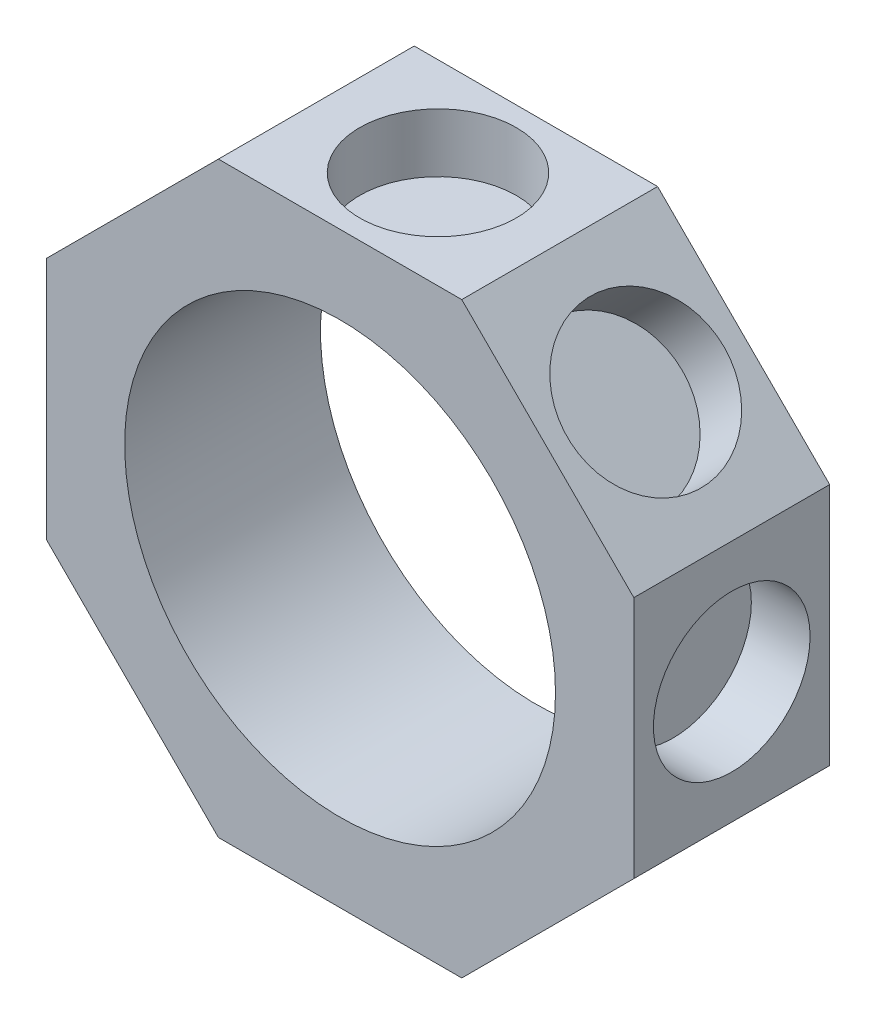
ISO-10303-21;
HEADER;
FILE_DESCRIPTION(('STEP AP214'),'2;1');
FILE_NAME('part.step','',(''),(''),'','','');
FILE_SCHEMA(('AUTOMOTIVE_DESIGN { 1 0 10303 214 1 1 1 1 }'));
ENDSEC;
DATA;
#1=APPLICATION_CONTEXT('core data for automotive mechanical design processes');
#2=APPLICATION_PROTOCOL_DEFINITION('international standard','automotive_design',2000,#1);
#3=PRODUCT_CONTEXT('',#1,'mechanical');
#4=PRODUCT('Part','Part','',(#3));
#5=PRODUCT_RELATED_PRODUCT_CATEGORY('part','',(#4));
#6=PRODUCT_DEFINITION_FORMATION('','',#4);
#7=PRODUCT_DEFINITION_CONTEXT('part definition',#1,'design');
#8=PRODUCT_DEFINITION('design','',#6,#7);
#9=PRODUCT_DEFINITION_SHAPE('','',#8);
#10=(LENGTH_UNIT() NAMED_UNIT(*) SI_UNIT(.MILLI.,.METRE.));
#11=(NAMED_UNIT(*) PLANE_ANGLE_UNIT() SI_UNIT($,.RADIAN.));
#12=(NAMED_UNIT(*) SI_UNIT($,.STERADIAN.) SOLID_ANGLE_UNIT());
#13=UNCERTAINTY_MEASURE_WITH_UNIT(LENGTH_MEASURE(1.E-05),#10,'distance_accuracy_value','');
#14=(GEOMETRIC_REPRESENTATION_CONTEXT(3) GLOBAL_UNCERTAINTY_ASSIGNED_CONTEXT((#13)) GLOBAL_UNIT_ASSIGNED_CONTEXT((#10,
#11,#12)) REPRESENTATION_CONTEXT('',''));
#15=CARTESIAN_POINT('',(0.,0.,0.));
#16=DIRECTION('',(0.,0.,1.));
#17=DIRECTION('',(1.,0.,0.));
#18=AXIS2_PLACEMENT_3D('',#15,#16,#17);
#19=CARTESIAN_POINT('',(0.,0.,5.));
#20=DIRECTION('',(0.,0.,1.));
#21=DIRECTION('',(1.,0.,0.));
#22=AXIS2_PLACEMENT_3D('',#19,#20,#21);
#23=PLANE('',#22);
#24=DIRECTION('',(-0.707106781186547,-0.707106781186548,0.));
#25=VECTOR('',#24,1.);
#26=CARTESIAN_POINT('',(-6.21320343559643,15.,5.));
#27=LINE('',#26,#25);
#28=CARTESIAN_POINT('',(-6.21320343559643,15.,5.));
#29=VERTEX_POINT('',#28);
#30=CARTESIAN_POINT('',(-15.,6.21320343559641,5.));
#31=VERTEX_POINT('',#30);
#32=EDGE_CURVE('E170',#29,#31,#27,.T.);
#33=ORIENTED_EDGE('',*,*,#32,.T.);
#34=DIRECTION('',(0.,-1.,0.));
#35=VECTOR('',#34,1.);
#36=CARTESIAN_POINT('',(-15.,6.21320343559641,5.));
#37=LINE('',#36,#35);
#38=CARTESIAN_POINT('',(-15.,-6.21320343559641,5.));
#39=VERTEX_POINT('',#38);
#40=EDGE_CURVE('E106',#31,#39,#37,.T.);
#41=ORIENTED_EDGE('',*,*,#40,.T.);
#42=DIRECTION('',(0.707106781186547,-0.707106781186548,0.));
#43=VECTOR('',#42,1.);
#44=CARTESIAN_POINT('',(-15.,-6.21320343559641,5.));
#45=LINE('',#44,#43);
#46=CARTESIAN_POINT('',(-6.2132034355964,-15.,5.));
#47=VERTEX_POINT('',#46);
#48=EDGE_CURVE('E191',#39,#47,#45,.T.);
#49=ORIENTED_EDGE('',*,*,#48,.T.);
#50=DIRECTION('',(1.,0.,0.));
#51=VECTOR('',#50,1.);
#52=CARTESIAN_POINT('',(-6.2132034355964,-15.,5.));
#53=LINE('',#52,#51);
#54=CARTESIAN_POINT('',(6.21320343559643,-15.,5.));
#55=VERTEX_POINT('',#54);
#56=EDGE_CURVE('E205',#47,#55,#53,.T.);
#57=ORIENTED_EDGE('',*,*,#56,.T.);
#58=DIRECTION('',(0.707106781186548,0.707106781186548,0.));
#59=VECTOR('',#58,1.);
#60=CARTESIAN_POINT('',(6.21320343559643,-15.,5.));
#61=LINE('',#60,#59);
#62=CARTESIAN_POINT('',(15.,-6.21320343559643,5.));
#63=VERTEX_POINT('',#62);
#64=EDGE_CURVE('E125',#55,#63,#61,.T.);
#65=ORIENTED_EDGE('',*,*,#64,.T.);
#66=DIRECTION('',(0.,1.,0.));
#67=VECTOR('',#66,1.);
#68=CARTESIAN_POINT('',(15.,-6.21320343559643,5.));
#69=LINE('',#68,#67);
#70=CARTESIAN_POINT('',(15.,6.21320343559643,5.));
#71=VERTEX_POINT('',#70);
#72=EDGE_CURVE('E119',#63,#71,#69,.T.);
#73=ORIENTED_EDGE('',*,*,#72,.T.);
#74=DIRECTION('',(-0.707106781186548,0.707106781186547,0.));
#75=VECTOR('',#74,1.);
#76=CARTESIAN_POINT('',(15.,6.21320343559643,5.));
#77=LINE('',#76,#75);
#78=CARTESIAN_POINT('',(6.21320343559642,15.,5.));
#79=VERTEX_POINT('',#78);
#80=EDGE_CURVE('E123',#71,#79,#77,.T.);
#81=ORIENTED_EDGE('',*,*,#80,.T.);
#82=DIRECTION('',(-1.,0.,0.));
#83=VECTOR('',#82,1.);
#84=CARTESIAN_POINT('',(6.21320343559642,15.,5.));
#85=LINE('',#84,#83);
#86=EDGE_CURVE('E63',#79,#29,#85,.T.);
#87=ORIENTED_EDGE('',*,*,#86,.T.);
#88=EDGE_LOOP('',(#33,#41,#49,#57,#65,#73,#81,#87));
#89=FACE_BOUND('',#88,.T.);
#90=CARTESIAN_POINT('',(0.,0.,5.));
#91=DIRECTION('',(0.,0.,1.));
#92=DIRECTION('',(1.,0.,0.));
#93=AXIS2_PLACEMENT_3D('',#90,#91,#92);
#94=CIRCLE('',#93,11.);
#95=CARTESIAN_POINT('',(11.,0.,5.));
#96=VERTEX_POINT('',#95);
#97=EDGE_CURVE('E152',#96,#96,#94,.T.);
#98=ORIENTED_EDGE('',*,*,#97,.F.);
#99=EDGE_LOOP('',(#98));
#100=FACE_BOUND('',#99,.T.);
#101=ADVANCED_FACE('F45',(#89,#100),#23,.T.);
#102=CARTESIAN_POINT('',(0.,0.,-5.));
#103=DIRECTION('',(0.,0.,1.));
#104=DIRECTION('',(1.,0.,0.));
#105=AXIS2_PLACEMENT_3D('',#102,#103,#104);
#106=PLANE('',#105);
#107=DIRECTION('',(-0.707106781186547,-0.707106781186548,0.));
#108=VECTOR('',#107,1.);
#109=CARTESIAN_POINT('',(-6.21320343559643,15.,-5.));
#110=LINE('',#109,#108);
#111=CARTESIAN_POINT('',(-6.21320343559643,15.,-5.));
#112=VERTEX_POINT('',#111);
#113=CARTESIAN_POINT('',(-15.,6.21320343559641,-5.));
#114=VERTEX_POINT('',#113);
#115=EDGE_CURVE('E147',#112,#114,#110,.T.);
#116=ORIENTED_EDGE('',*,*,#115,.F.);
#117=DIRECTION('',(-1.,0.,0.));
#118=VECTOR('',#117,1.);
#119=CARTESIAN_POINT('',(6.21320343559642,15.,-5.));
#120=LINE('',#119,#118);
#121=CARTESIAN_POINT('',(6.21320343559642,15.,-5.));
#122=VERTEX_POINT('',#121);
#123=EDGE_CURVE('E98',#122,#112,#120,.T.);
#124=ORIENTED_EDGE('',*,*,#123,.F.);
#125=DIRECTION('',(-0.707106781186548,0.707106781186547,0.));
#126=VECTOR('',#125,1.);
#127=CARTESIAN_POINT('',(15.,6.21320343559643,-5.));
#128=LINE('',#127,#126);
#129=CARTESIAN_POINT('',(15.,6.21320343559643,-5.));
#130=VERTEX_POINT('',#129);
#131=EDGE_CURVE('E92',#130,#122,#128,.T.);
#132=ORIENTED_EDGE('',*,*,#131,.F.);
#133=DIRECTION('',(0.,1.,0.));
#134=VECTOR('',#133,1.);
#135=CARTESIAN_POINT('',(15.,-6.21320343559643,-5.));
#136=LINE('',#135,#134);
#137=CARTESIAN_POINT('',(15.,-6.21320343559643,-5.));
#138=VERTEX_POINT('',#137);
#139=EDGE_CURVE('E134',#138,#130,#136,.T.);
#140=ORIENTED_EDGE('',*,*,#139,.F.);
#141=DIRECTION('',(0.707106781186548,0.707106781186548,0.));
#142=VECTOR('',#141,1.);
#143=CARTESIAN_POINT('',(6.21320343559643,-15.,-5.));
#144=LINE('',#143,#142);
#145=CARTESIAN_POINT('',(6.21320343559643,-15.,-5.));
#146=VERTEX_POINT('',#145);
#147=EDGE_CURVE('E161',#146,#138,#144,.T.);
#148=ORIENTED_EDGE('',*,*,#147,.F.);
#149=DIRECTION('',(1.,0.,0.));
#150=VECTOR('',#149,1.);
#151=CARTESIAN_POINT('',(-6.2132034355964,-15.,-5.));
#152=LINE('',#151,#150);
#153=CARTESIAN_POINT('',(-6.2132034355964,-15.,-5.));
#154=VERTEX_POINT('',#153);
#155=EDGE_CURVE('E158',#154,#146,#152,.T.);
#156=ORIENTED_EDGE('',*,*,#155,.F.);
#157=DIRECTION('',(0.707106781186547,-0.707106781186548,0.));
#158=VECTOR('',#157,1.);
#159=CARTESIAN_POINT('',(-15.,-6.21320343559641,-5.));
#160=LINE('',#159,#158);
#161=CARTESIAN_POINT('',(-15.,-6.21320343559641,-5.));
#162=VERTEX_POINT('',#161);
#163=EDGE_CURVE('E155',#162,#154,#160,.T.);
#164=ORIENTED_EDGE('',*,*,#163,.F.);
#165=DIRECTION('',(0.,-1.,0.));
#166=VECTOR('',#165,1.);
#167=CARTESIAN_POINT('',(-15.,6.21320343559641,-5.));
#168=LINE('',#167,#166);
#169=EDGE_CURVE('E151',#114,#162,#168,.T.);
#170=ORIENTED_EDGE('',*,*,#169,.F.);
#171=EDGE_LOOP('',(#116,#124,#132,#140,#148,#156,#164,#170));
#172=FACE_BOUND('',#171,.T.);
#173=CARTESIAN_POINT('',(0.,0.,-5.));
#174=DIRECTION('',(0.,0.,1.));
#175=DIRECTION('',(1.,0.,0.));
#176=AXIS2_PLACEMENT_3D('',#173,#174,#175);
#177=CIRCLE('',#176,11.);
#178=CARTESIAN_POINT('',(11.,0.,-5.));
#179=VERTEX_POINT('',#178);
#180=EDGE_CURVE('E215',#179,#179,#177,.T.);
#181=ORIENTED_EDGE('',*,*,#180,.T.);
#182=EDGE_LOOP('',(#181));
#183=FACE_BOUND('',#182,.T.);
#184=ADVANCED_FACE('F195',(#172,#183),#106,.F.);
#185=CARTESIAN_POINT('',(-6.21320343559643,15.,5.));
#186=DIRECTION('',(0.707106781186548,-0.707106781186547,0.));
#187=DIRECTION('',(0.707106781186547,0.707106781186548,0.));
#188=AXIS2_PLACEMENT_3D('',#185,#186,#187);
#189=PLANE('',#188);
#190=CARTESIAN_POINT('',(-10.6066017177983,10.6066017177981,0.));
#191=DIRECTION('',(-0.707106781186554,0.707106781186541,0.));
#192=DIRECTION('',(0.,0.,-1.));
#193=AXIS2_PLACEMENT_3D('',#190,#191,#192);
#194=CIRCLE('',#193,4.);
#195=CARTESIAN_POINT('',(-10.6066017177983,10.6066017177981,-4.));
#196=VERTEX_POINT('',#195);
#197=EDGE_CURVE('E239',#196,#196,#194,.T.);
#198=ORIENTED_EDGE('',*,*,#197,.F.);
#199=EDGE_LOOP('',(#198));
#200=FACE_BOUND('',#199,.T.);
#201=ORIENTED_EDGE('',*,*,#115,.T.);
#202=DIRECTION('',(0.,0.,-1.));
#203=VECTOR('',#202,1.);
#204=CARTESIAN_POINT('',(-15.,6.21320343559641,5.));
#205=LINE('',#204,#203);
#206=EDGE_CURVE('E11',#31,#114,#205,.T.);
#207=ORIENTED_EDGE('',*,*,#206,.F.);
#208=ORIENTED_EDGE('',*,*,#32,.F.);
#209=DIRECTION('',(0.,0.,-1.));
#210=VECTOR('',#209,1.);
#211=CARTESIAN_POINT('',(-6.21320343559643,15.,5.));
#212=LINE('',#211,#210);
#213=EDGE_CURVE('E143',#29,#112,#212,.T.);
#214=ORIENTED_EDGE('',*,*,#213,.T.);
#215=EDGE_LOOP('',(#201,#207,#208,#214));
#216=FACE_BOUND('',#215,.T.);
#217=ADVANCED_FACE('F47',(#200,#216),#189,.F.);
#218=CARTESIAN_POINT('',(-15.,6.21320343559641,5.));
#219=DIRECTION('',(1.,0.,0.));
#220=DIRECTION('',(0.,0.,-1.));
#221=AXIS2_PLACEMENT_3D('',#218,#219,#220);
#222=PLANE('',#221);
#223=CARTESIAN_POINT('',(-15.,-1.57116660247941E-13,0.));
#224=DIRECTION('',(-1.,0.,0.));
#225=DIRECTION('',(0.,0.,-1.));
#226=AXIS2_PLACEMENT_3D('',#223,#224,#225);
#227=CIRCLE('',#226,4.);
#228=CARTESIAN_POINT('',(-15.,-1.57116660247941E-13,-4.));
#229=VERTEX_POINT('',#228);
#230=EDGE_CURVE('E279',#229,#229,#227,.T.);
#231=ORIENTED_EDGE('',*,*,#230,.F.);
#232=EDGE_LOOP('',(#231));
#233=FACE_BOUND('',#232,.T.);
#234=ORIENTED_EDGE('',*,*,#169,.T.);
#235=DIRECTION('',(0.,0.,-1.));
#236=VECTOR('',#235,1.);
#237=CARTESIAN_POINT('',(-15.,-6.21320343559641,5.));
#238=LINE('',#237,#236);
#239=EDGE_CURVE('E55',#39,#162,#238,.T.);
#240=ORIENTED_EDGE('',*,*,#239,.F.);
#241=ORIENTED_EDGE('',*,*,#40,.F.);
#242=ORIENTED_EDGE('',*,*,#206,.T.);
#243=EDGE_LOOP('',(#234,#240,#241,#242));
#244=FACE_BOUND('',#243,.T.);
#245=ADVANCED_FACE('F296',(#233,#244),#222,.F.);
#246=CARTESIAN_POINT('',(-15.,-6.21320343559641,5.));
#247=DIRECTION('',(0.707106781186548,0.707106781186547,0.));
#248=DIRECTION('',(-0.707106781186547,0.707106781186548,0.));
#249=AXIS2_PLACEMENT_3D('',#246,#247,#248);
#250=PLANE('',#249);
#251=CARTESIAN_POINT('',(-10.6066017177981,-10.6066017177983,0.));
#252=DIRECTION('',(-0.707106781186539,-0.707106781186556,0.));
#253=DIRECTION('',(0.,0.,-1.));
#254=AXIS2_PLACEMENT_3D('',#251,#252,#253);
#255=CIRCLE('',#254,4.);
#256=CARTESIAN_POINT('',(-10.6066017177981,-10.6066017177983,-4.));
#257=VERTEX_POINT('',#256);
#258=EDGE_CURVE('E271',#257,#257,#255,.T.);
#259=ORIENTED_EDGE('',*,*,#258,.F.);
#260=EDGE_LOOP('',(#259));
#261=FACE_BOUND('',#260,.T.);
#262=ORIENTED_EDGE('',*,*,#163,.T.);
#263=DIRECTION('',(0.,0.,-1.));
#264=VECTOR('',#263,1.);
#265=CARTESIAN_POINT('',(-6.2132034355964,-15.,5.));
#266=LINE('',#265,#264);
#267=EDGE_CURVE('E181',#47,#154,#266,.T.);
#268=ORIENTED_EDGE('',*,*,#267,.F.);
#269=ORIENTED_EDGE('',*,*,#48,.F.);
#270=ORIENTED_EDGE('',*,*,#239,.T.);
#271=EDGE_LOOP('',(#262,#268,#269,#270));
#272=FACE_BOUND('',#271,.T.);
#273=ADVANCED_FACE('F189',(#261,#272),#250,.F.);
#274=CARTESIAN_POINT('',(-6.2132034355964,-15.,5.));
#275=DIRECTION('',(0.,1.,0.));
#276=DIRECTION('',(0.,0.,1.));
#277=AXIS2_PLACEMENT_3D('',#274,#275,#276);
#278=PLANE('',#277);
#279=CARTESIAN_POINT('',(0.,-15.,0.));
#280=DIRECTION('',(0.,-1.,0.));
#281=DIRECTION('',(0.,0.,-1.));
#282=AXIS2_PLACEMENT_3D('',#279,#280,#281);
#283=CIRCLE('',#282,4.);
#284=CARTESIAN_POINT('',(0.,-15.,-4.));
#285=VERTEX_POINT('',#284);
#286=EDGE_CURVE('E223',#285,#285,#283,.T.);
#287=ORIENTED_EDGE('',*,*,#286,.F.);
#288=EDGE_LOOP('',(#287));
#289=FACE_BOUND('',#288,.T.);
#290=ORIENTED_EDGE('',*,*,#155,.T.);
#291=DIRECTION('',(0.,0.,-1.));
#292=VECTOR('',#291,1.);
#293=CARTESIAN_POINT('',(6.21320343559643,-15.,5.));
#294=LINE('',#293,#292);
#295=EDGE_CURVE('E177',#55,#146,#294,.T.);
#296=ORIENTED_EDGE('',*,*,#295,.F.);
#297=ORIENTED_EDGE('',*,*,#56,.F.);
#298=ORIENTED_EDGE('',*,*,#267,.T.);
#299=EDGE_LOOP('',(#290,#296,#297,#298));
#300=FACE_BOUND('',#299,.T.);
#301=ADVANCED_FACE('F200',(#289,#300),#278,.F.);
#302=CARTESIAN_POINT('',(6.21320343559643,-15.,5.));
#303=DIRECTION('',(-0.707106781186548,0.707106781186548,0.));
#304=DIRECTION('',(-0.707106781186548,-0.707106781186548,0.));
#305=AXIS2_PLACEMENT_3D('',#302,#303,#304);
#306=PLANE('',#305);
#307=CARTESIAN_POINT('',(10.6066017177982,-10.6066017177982,0.));
#308=DIRECTION('',(0.707106781186549,-0.707106781186546,0.));
#309=DIRECTION('',(0.,0.,-1.));
#310=AXIS2_PLACEMENT_3D('',#307,#308,#309);
#311=CIRCLE('',#310,4.);
#312=CARTESIAN_POINT('',(10.6066017177982,-10.6066017177982,-4.));
#313=VERTEX_POINT('',#312);
#314=EDGE_CURVE('E231',#313,#313,#311,.T.);
#315=ORIENTED_EDGE('',*,*,#314,.F.);
#316=EDGE_LOOP('',(#315));
#317=FACE_BOUND('',#316,.T.);
#318=ORIENTED_EDGE('',*,*,#147,.T.);
#319=DIRECTION('',(0.,0.,-1.));
#320=VECTOR('',#319,1.);
#321=CARTESIAN_POINT('',(15.,-6.21320343559643,5.));
#322=LINE('',#321,#320);
#323=EDGE_CURVE('E136',#63,#138,#322,.T.);
#324=ORIENTED_EDGE('',*,*,#323,.F.);
#325=ORIENTED_EDGE('',*,*,#64,.F.);
#326=ORIENTED_EDGE('',*,*,#295,.T.);
#327=EDGE_LOOP('',(#318,#324,#325,#326));
#328=FACE_BOUND('',#327,.T.);
#329=ADVANCED_FACE('F203',(#317,#328),#306,.F.);
#330=CARTESIAN_POINT('',(15.,-6.21320343559643,5.));
#331=DIRECTION('',(-1.,0.,0.));
#332=DIRECTION('',(0.,-1.,0.));
#333=AXIS2_PLACEMENT_3D('',#330,#331,#332);
#334=PLANE('',#333);
#335=CARTESIAN_POINT('',(15.,0.,0.));
#336=DIRECTION('',(1.,0.,0.));
#337=DIRECTION('',(0.,0.,-1.));
#338=AXIS2_PLACEMENT_3D('',#335,#336,#337);
#339=CIRCLE('',#338,4.);
#340=CARTESIAN_POINT('',(15.,0.,-4.));
#341=VERTEX_POINT('',#340);
#342=EDGE_CURVE('E264',#341,#341,#339,.T.);
#343=ORIENTED_EDGE('',*,*,#342,.F.);
#344=EDGE_LOOP('',(#343));
#345=FACE_BOUND('',#344,.T.);
#346=ORIENTED_EDGE('',*,*,#139,.T.);
#347=DIRECTION('',(0.,0.,-1.));
#348=VECTOR('',#347,1.);
#349=CARTESIAN_POINT('',(15.,6.21320343559643,5.));
#350=LINE('',#349,#348);
#351=EDGE_CURVE('E131',#71,#130,#350,.T.);
#352=ORIENTED_EDGE('',*,*,#351,.F.);
#353=ORIENTED_EDGE('',*,*,#72,.F.);
#354=ORIENTED_EDGE('',*,*,#323,.T.);
#355=EDGE_LOOP('',(#346,#352,#353,#354));
#356=FACE_BOUND('',#355,.T.);
#357=ADVANCED_FACE('F132',(#345,#356),#334,.F.);
#358=CARTESIAN_POINT('',(15.,6.21320343559643,5.));
#359=DIRECTION('',(-0.707106781186547,-0.707106781186548,0.));
#360=DIRECTION('',(0.707106781186548,-0.707106781186547,0.));
#361=AXIS2_PLACEMENT_3D('',#358,#359,#360);
#362=PLANE('',#361);
#363=CARTESIAN_POINT('',(10.6066017177982,10.6066017177983,0.));
#364=DIRECTION('',(0.707106781186544,0.707106781186551,0.));
#365=DIRECTION('',(0.,0.,-1.));
#366=AXIS2_PLACEMENT_3D('',#363,#364,#365);
#367=CIRCLE('',#366,4.);
#368=CARTESIAN_POINT('',(10.6066017177982,10.6066017177983,-4.));
#369=VERTEX_POINT('',#368);
#370=EDGE_CURVE('E256',#369,#369,#367,.T.);
#371=ORIENTED_EDGE('',*,*,#370,.F.);
#372=EDGE_LOOP('',(#371));
#373=FACE_BOUND('',#372,.T.);
#374=ORIENTED_EDGE('',*,*,#131,.T.);
#375=DIRECTION('',(0.,0.,-1.));
#376=VECTOR('',#375,1.);
#377=CARTESIAN_POINT('',(6.21320343559642,15.,5.));
#378=LINE('',#377,#376);
#379=EDGE_CURVE('E137',#79,#122,#378,.T.);
#380=ORIENTED_EDGE('',*,*,#379,.F.);
#381=ORIENTED_EDGE('',*,*,#80,.F.);
#382=ORIENTED_EDGE('',*,*,#351,.T.);
#383=EDGE_LOOP('',(#374,#380,#381,#382));
#384=FACE_BOUND('',#383,.T.);
#385=ADVANCED_FACE('F139',(#373,#384),#362,.F.);
#386=CARTESIAN_POINT('',(6.21320343559642,15.,5.));
#387=DIRECTION('',(0.,-1.,0.));
#388=DIRECTION('',(1.,0.,0.));
#389=AXIS2_PLACEMENT_3D('',#386,#387,#388);
#390=PLANE('',#389);
#391=CARTESIAN_POINT('',(0.,15.,0.));
#392=DIRECTION('',(0.,1.,0.));
#393=DIRECTION('',(0.,0.,-1.));
#394=AXIS2_PLACEMENT_3D('',#391,#392,#393);
#395=CIRCLE('',#394,4.);
#396=CARTESIAN_POINT('',(0.,15.,-4.));
#397=VERTEX_POINT('',#396);
#398=EDGE_CURVE('E248',#397,#397,#395,.T.);
#399=ORIENTED_EDGE('',*,*,#398,.F.);
#400=EDGE_LOOP('',(#399));
#401=FACE_BOUND('',#400,.T.);
#402=ORIENTED_EDGE('',*,*,#123,.T.);
#403=ORIENTED_EDGE('',*,*,#213,.F.);
#404=ORIENTED_EDGE('',*,*,#86,.F.);
#405=ORIENTED_EDGE('',*,*,#379,.T.);
#406=EDGE_LOOP('',(#402,#403,#404,#405));
#407=FACE_BOUND('',#406,.T.);
#408=ADVANCED_FACE('F301',(#401,#407),#390,.F.);
#409=CARTESIAN_POINT('',(0.,0.,5.));
#410=DIRECTION('',(0.,0.,-1.));
#411=DIRECTION('',(-1.,0.,0.));
#412=AXIS2_PLACEMENT_3D('',#409,#410,#411);
#413=CYLINDRICAL_SURFACE('',#412,11.);
#414=ORIENTED_EDGE('',*,*,#97,.T.);
#415=EDGE_LOOP('',(#414));
#416=FACE_BOUND('',#415,.T.);
#417=ORIENTED_EDGE('',*,*,#180,.F.);
#418=EDGE_LOOP('',(#417));
#419=FACE_BOUND('',#418,.T.);
#420=ADVANCED_FACE('F303',(#416,#419),#413,.F.);
#421=CARTESIAN_POINT('',(0.,-12.,0.));
#422=DIRECTION('',(0.,-1.,0.));
#423=DIRECTION('',(0.,0.,-1.));
#424=AXIS2_PLACEMENT_3D('',#421,#422,#423);
#425=CYLINDRICAL_SURFACE('',#424,4.);
#426=CARTESIAN_POINT('',(0.,-12.,0.));
#427=DIRECTION('',(0.,-1.,0.));
#428=DIRECTION('',(0.,0.,-1.));
#429=AXIS2_PLACEMENT_3D('',#426,#427,#428);
#430=CIRCLE('',#429,4.);
#431=CARTESIAN_POINT('',(0.,-12.,-4.));
#432=VERTEX_POINT('',#431);
#433=EDGE_CURVE('E219',#432,#432,#430,.T.);
#434=ORIENTED_EDGE('',*,*,#433,.F.);
#435=EDGE_LOOP('',(#434));
#436=FACE_BOUND('',#435,.T.);
#437=ORIENTED_EDGE('',*,*,#286,.T.);
#438=EDGE_LOOP('',(#437));
#439=FACE_BOUND('',#438,.T.);
#440=ADVANCED_FACE('F311',(#436,#439),#425,.F.);
#441=CARTESIAN_POINT('',(0.,-12.,0.));
#442=DIRECTION('',(0.,-1.,0.));
#443=DIRECTION('',(0.,0.,-1.));
#444=AXIS2_PLACEMENT_3D('',#441,#442,#443);
#445=PLANE('',#444);
#446=ORIENTED_EDGE('',*,*,#433,.T.);
#447=EDGE_LOOP('',(#446));
#448=FACE_BOUND('',#447,.T.);
#449=ADVANCED_FACE('F326',(#448),#445,.T.);
#450=CARTESIAN_POINT('',(0.,12.,0.));
#451=DIRECTION('',(0.,1.,0.));
#452=DIRECTION('',(0.,0.,1.));
#453=AXIS2_PLACEMENT_3D('',#450,#451,#452);
#454=CYLINDRICAL_SURFACE('',#453,4.);
#455=CARTESIAN_POINT('',(0.,12.,0.));
#456=DIRECTION('',(0.,1.,0.));
#457=DIRECTION('',(0.,0.,-1.));
#458=AXIS2_PLACEMENT_3D('',#455,#456,#457);
#459=CIRCLE('',#458,4.);
#460=CARTESIAN_POINT('',(0.,12.,-4.));
#461=VERTEX_POINT('',#460);
#462=EDGE_CURVE('E252',#461,#461,#459,.T.);
#463=ORIENTED_EDGE('',*,*,#462,.F.);
#464=EDGE_LOOP('',(#463));
#465=FACE_BOUND('',#464,.T.);
#466=ORIENTED_EDGE('',*,*,#398,.T.);
#467=EDGE_LOOP('',(#466));
#468=FACE_BOUND('',#467,.T.);
#469=ADVANCED_FACE('F330',(#465,#468),#454,.F.);
#470=CARTESIAN_POINT('',(0.,12.,0.));
#471=DIRECTION('',(0.,1.,0.));
#472=DIRECTION('',(0.,0.,-1.));
#473=AXIS2_PLACEMENT_3D('',#470,#471,#472);
#474=PLANE('',#473);
#475=ORIENTED_EDGE('',*,*,#462,.T.);
#476=EDGE_LOOP('',(#475));
#477=FACE_BOUND('',#476,.T.);
#478=ADVANCED_FACE('F351',(#477),#474,.T.);
#479=CARTESIAN_POINT('',(8.48528137423853,8.48528137423861,0.));
#480=DIRECTION('',(0.707106781186544,0.707106781186551,0.));
#481=DIRECTION('',(-0.707106781186551,0.707106781186544,0.));
#482=AXIS2_PLACEMENT_3D('',#479,#480,#481);
#483=CYLINDRICAL_SURFACE('',#482,4.);
#484=CARTESIAN_POINT('',(8.48528137423853,8.48528137423861,0.));
#485=DIRECTION('',(0.707106781186544,0.707106781186551,0.));
#486=DIRECTION('',(0.,0.,-1.));
#487=AXIS2_PLACEMENT_3D('',#484,#485,#486);
#488=CIRCLE('',#487,4.);
#489=CARTESIAN_POINT('',(8.48528137423853,8.48528137423861,-4.));
#490=VERTEX_POINT('',#489);
#491=EDGE_CURVE('E260',#490,#490,#488,.T.);
#492=ORIENTED_EDGE('',*,*,#491,.F.);
#493=EDGE_LOOP('',(#492));
#494=FACE_BOUND('',#493,.T.);
#495=ORIENTED_EDGE('',*,*,#370,.T.);
#496=EDGE_LOOP('',(#495));
#497=FACE_BOUND('',#496,.T.);
#498=ADVANCED_FACE('F355',(#494,#497),#483,.F.);
#499=CARTESIAN_POINT('',(8.48528137423853,8.48528137423861,0.));
#500=DIRECTION('',(0.707106781186544,0.707106781186551,0.));
#501=DIRECTION('',(0.,0.,-1.));
#502=AXIS2_PLACEMENT_3D('',#499,#500,#501);
#503=PLANE('',#502);
#504=ORIENTED_EDGE('',*,*,#491,.T.);
#505=EDGE_LOOP('',(#504));
#506=FACE_BOUND('',#505,.T.);
#507=ADVANCED_FACE('F359',(#506),#503,.T.);
#508=CARTESIAN_POINT('',(12.,0.,0.));
#509=DIRECTION('',(1.,0.,0.));
#510=DIRECTION('',(0.,1.,0.));
#511=AXIS2_PLACEMENT_3D('',#508,#509,#510);
#512=CYLINDRICAL_SURFACE('',#511,4.);
#513=CARTESIAN_POINT('',(12.,0.,0.));
#514=DIRECTION('',(1.,0.,0.));
#515=DIRECTION('',(0.,0.,-1.));
#516=AXIS2_PLACEMENT_3D('',#513,#514,#515);
#517=CIRCLE('',#516,4.);
#518=CARTESIAN_POINT('',(12.,0.,-4.));
#519=VERTEX_POINT('',#518);
#520=EDGE_CURVE('E235',#519,#519,#517,.T.);
#521=ORIENTED_EDGE('',*,*,#520,.F.);
#522=EDGE_LOOP('',(#521));
#523=FACE_BOUND('',#522,.T.);
#524=ORIENTED_EDGE('',*,*,#342,.T.);
#525=EDGE_LOOP('',(#524));
#526=FACE_BOUND('',#525,.T.);
#527=ADVANCED_FACE('F363',(#523,#526),#512,.F.);
#528=CARTESIAN_POINT('',(12.,0.,0.));
#529=DIRECTION('',(1.,0.,0.));
#530=DIRECTION('',(0.,0.,-1.));
#531=AXIS2_PLACEMENT_3D('',#528,#529,#530);
#532=PLANE('',#531);
#533=ORIENTED_EDGE('',*,*,#520,.T.);
#534=EDGE_LOOP('',(#533));
#535=FACE_BOUND('',#534,.T.);
#536=ADVANCED_FACE('F336',(#535),#532,.T.);
#537=CARTESIAN_POINT('',(8.48528137423859,-8.48528137423856,0.));
#538=DIRECTION('',(0.707106781186549,-0.707106781186546,0.));
#539=DIRECTION('',(0.707106781186546,0.707106781186549,0.));
#540=AXIS2_PLACEMENT_3D('',#537,#538,#539);
#541=CYLINDRICAL_SURFACE('',#540,4.);
#542=CARTESIAN_POINT('',(8.48528137423859,-8.48528137423856,0.));
#543=DIRECTION('',(0.707106781186549,-0.707106781186546,0.));
#544=DIRECTION('',(0.,0.,-1.));
#545=AXIS2_PLACEMENT_3D('',#542,#543,#544);
#546=CIRCLE('',#545,4.);
#547=CARTESIAN_POINT('',(8.48528137423859,-8.48528137423856,-4.));
#548=VERTEX_POINT('',#547);
#549=EDGE_CURVE('E227',#548,#548,#546,.T.);
#550=ORIENTED_EDGE('',*,*,#549,.F.);
#551=EDGE_LOOP('',(#550));
#552=FACE_BOUND('',#551,.T.);
#553=ORIENTED_EDGE('',*,*,#314,.T.);
#554=EDGE_LOOP('',(#553));
#555=FACE_BOUND('',#554,.T.);
#556=ADVANCED_FACE('F332',(#552,#555),#541,.F.);
#557=CARTESIAN_POINT('',(8.48528137423859,-8.48528137423856,0.));
#558=DIRECTION('',(0.707106781186549,-0.707106781186546,0.));
#559=DIRECTION('',(0.,0.,-1.));
#560=AXIS2_PLACEMENT_3D('',#557,#558,#559);
#561=PLANE('',#560);
#562=ORIENTED_EDGE('',*,*,#549,.T.);
#563=EDGE_LOOP('',(#562));
#564=FACE_BOUND('',#563,.T.);
#565=ADVANCED_FACE('F335',(#564),#561,.T.);
#566=CARTESIAN_POINT('',(-8.48528137423847,-8.48528137423867,0.));
#567=DIRECTION('',(-0.707106781186539,-0.707106781186556,0.));
#568=DIRECTION('',(0.707106781186556,-0.707106781186539,0.));
#569=AXIS2_PLACEMENT_3D('',#566,#567,#568);
#570=CYLINDRICAL_SURFACE('',#569,4.);
#571=CARTESIAN_POINT('',(-8.48528137423847,-8.48528137423867,0.));
#572=DIRECTION('',(-0.707106781186539,-0.707106781186556,0.));
#573=DIRECTION('',(0.,0.,-1.));
#574=AXIS2_PLACEMENT_3D('',#571,#572,#573);
#575=CIRCLE('',#574,4.);
#576=CARTESIAN_POINT('',(-8.48528137423847,-8.48528137423867,-4.));
#577=VERTEX_POINT('',#576);
#578=EDGE_CURVE('E275',#577,#577,#575,.T.);
#579=ORIENTED_EDGE('',*,*,#578,.F.);
#580=EDGE_LOOP('',(#579));
#581=FACE_BOUND('',#580,.T.);
#582=ORIENTED_EDGE('',*,*,#258,.T.);
#583=EDGE_LOOP('',(#582));
#584=FACE_BOUND('',#583,.T.);
#585=ADVANCED_FACE('F340',(#581,#584),#570,.F.);
#586=CARTESIAN_POINT('',(-8.48528137423847,-8.48528137423867,0.));
#587=DIRECTION('',(-0.707106781186539,-0.707106781186556,0.));
#588=DIRECTION('',(0.,0.,-1.));
#589=AXIS2_PLACEMENT_3D('',#586,#587,#588);
#590=PLANE('',#589);
#591=ORIENTED_EDGE('',*,*,#578,.T.);
#592=EDGE_LOOP('',(#591));
#593=FACE_BOUND('',#592,.T.);
#594=ADVANCED_FACE('F292',(#593),#590,.T.);
#595=CARTESIAN_POINT('',(-12.,-1.25693328198353E-13,0.));
#596=DIRECTION('',(-1.,0.,0.));
#597=DIRECTION('',(0.,-1.,0.));
#598=AXIS2_PLACEMENT_3D('',#595,#596,#597);
#599=CYLINDRICAL_SURFACE('',#598,4.);
#600=CARTESIAN_POINT('',(-12.,-1.25693328198353E-13,0.));
#601=DIRECTION('',(-1.,0.,0.));
#602=DIRECTION('',(0.,0.,-1.));
#603=AXIS2_PLACEMENT_3D('',#600,#601,#602);
#604=CIRCLE('',#603,4.);
#605=CARTESIAN_POINT('',(-12.,-1.25693328198353E-13,-4.));
#606=VERTEX_POINT('',#605);
#607=EDGE_CURVE('E244',#606,#606,#604,.T.);
#608=ORIENTED_EDGE('',*,*,#607,.F.);
#609=EDGE_LOOP('',(#608));
#610=FACE_BOUND('',#609,.T.);
#611=ORIENTED_EDGE('',*,*,#230,.T.);
#612=EDGE_LOOP('',(#611));
#613=FACE_BOUND('',#612,.T.);
#614=ADVANCED_FACE('F289',(#610,#613),#599,.F.);
#615=CARTESIAN_POINT('',(-12.,-1.25693328198353E-13,0.));
#616=DIRECTION('',(-1.,0.,0.));
#617=DIRECTION('',(0.,0.,-1.));
#618=AXIS2_PLACEMENT_3D('',#615,#616,#617);
#619=PLANE('',#618);
#620=ORIENTED_EDGE('',*,*,#607,.T.);
#621=EDGE_LOOP('',(#620));
#622=FACE_BOUND('',#621,.T.);
#623=ADVANCED_FACE('F287',(#622),#619,.T.);
#624=CARTESIAN_POINT('',(-8.48528137423864,8.48528137423849,0.));
#625=DIRECTION('',(-0.707106781186554,0.707106781186541,0.));
#626=DIRECTION('',(-0.707106781186541,-0.707106781186554,0.));
#627=AXIS2_PLACEMENT_3D('',#624,#625,#626);
#628=CYLINDRICAL_SURFACE('',#627,4.);
#629=CARTESIAN_POINT('',(-8.48528137423864,8.48528137423849,0.));
#630=DIRECTION('',(-0.707106781186554,0.707106781186541,0.));
#631=DIRECTION('',(0.,0.,-1.));
#632=AXIS2_PLACEMENT_3D('',#629,#630,#631);
#633=CIRCLE('',#632,4.);
#634=CARTESIAN_POINT('',(-8.48528137423864,8.48528137423849,-4.));
#635=VERTEX_POINT('',#634);
#636=EDGE_CURVE('E243',#635,#635,#633,.T.);
#637=ORIENTED_EDGE('',*,*,#636,.F.);
#638=EDGE_LOOP('',(#637));
#639=FACE_BOUND('',#638,.T.);
#640=ORIENTED_EDGE('',*,*,#197,.T.);
#641=EDGE_LOOP('',(#640));
#642=FACE_BOUND('',#641,.T.);
#643=ADVANCED_FACE('F342',(#639,#642),#628,.F.);
#644=CARTESIAN_POINT('',(-8.48528137423864,8.48528137423849,0.));
#645=DIRECTION('',(-0.707106781186554,0.707106781186541,0.));
#646=DIRECTION('',(0.,0.,-1.));
#647=AXIS2_PLACEMENT_3D('',#644,#645,#646);
#648=PLANE('',#647);
#649=ORIENTED_EDGE('',*,*,#636,.T.);
#650=EDGE_LOOP('',(#649));
#651=FACE_BOUND('',#650,.T.);
#652=ADVANCED_FACE('F345',(#651),#648,.T.);
#653=CLOSED_SHELL('',(#101,#184,#217,#245,#273,#301,#329,#357,#385,#408,#420,#440,#449,#469,
#478,#498,#507,#527,#536,#556,#565,#585,#594,#614,#623,#643,#652));
#654=MANIFOLD_SOLID_BREP('B2',#653);
#655=ADVANCED_BREP_SHAPE_REPRESENTATION('',(#18,#654),#14);
#656=SHAPE_DEFINITION_REPRESENTATION(#9,#655);
ENDSEC;
END-ISO-10303-21;
